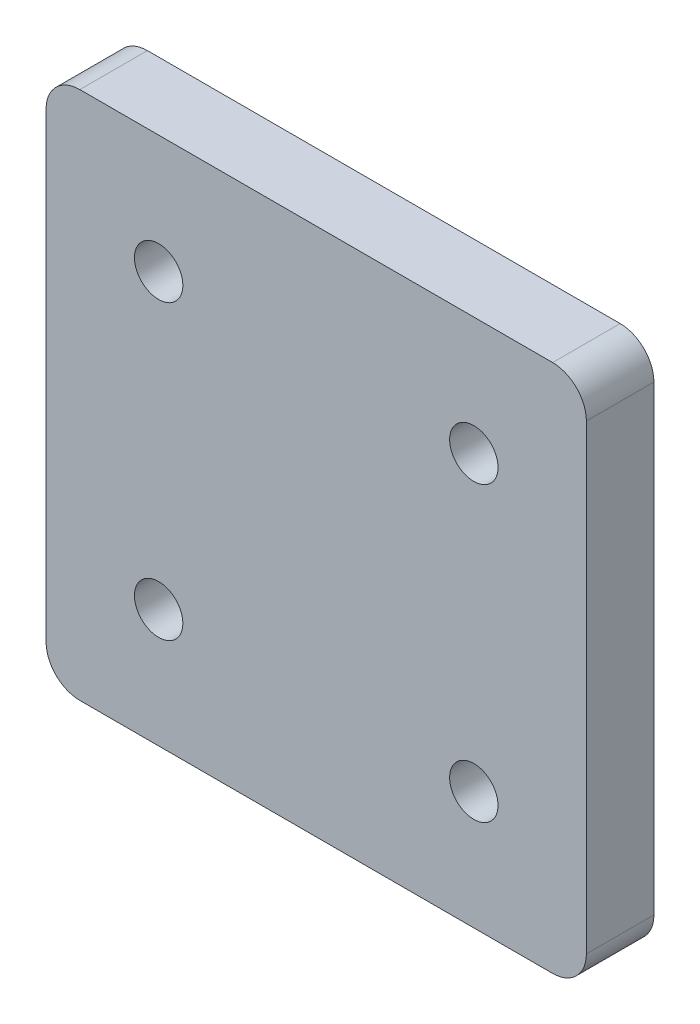
ISO-10303-21;
HEADER;
FILE_DESCRIPTION(('STEP AP214'),'2;1');
FILE_NAME('part.step','',(''),(''),'','','');
FILE_SCHEMA(('AUTOMOTIVE_DESIGN { 1 0 10303 214 1 1 1 1 }'));
ENDSEC;
DATA;
#1=APPLICATION_CONTEXT('core data for automotive mechanical design processes');
#2=APPLICATION_PROTOCOL_DEFINITION('international standard','automotive_design',2000,#1);
#3=PRODUCT_CONTEXT('',#1,'mechanical');
#4=PRODUCT('Part','Part','',(#3));
#5=PRODUCT_RELATED_PRODUCT_CATEGORY('part','',(#4));
#6=PRODUCT_DEFINITION_FORMATION('','',#4);
#7=PRODUCT_DEFINITION_CONTEXT('part definition',#1,'design');
#8=PRODUCT_DEFINITION('design','',#6,#7);
#9=PRODUCT_DEFINITION_SHAPE('','',#8);
#10=(LENGTH_UNIT() NAMED_UNIT(*) SI_UNIT(.MILLI.,.METRE.));
#11=(NAMED_UNIT(*) PLANE_ANGLE_UNIT() SI_UNIT($,.RADIAN.));
#12=(NAMED_UNIT(*) SI_UNIT($,.STERADIAN.) SOLID_ANGLE_UNIT());
#13=UNCERTAINTY_MEASURE_WITH_UNIT(LENGTH_MEASURE(1.E-05),#10,'distance_accuracy_value','');
#14=(GEOMETRIC_REPRESENTATION_CONTEXT(3) GLOBAL_UNCERTAINTY_ASSIGNED_CONTEXT((#13)) GLOBAL_UNIT_ASSIGNED_CONTEXT((#10,
#11,#12)) REPRESENTATION_CONTEXT('',''));
#15=CARTESIAN_POINT('',(0.,0.,0.));
#16=DIRECTION('',(0.,0.,1.));
#17=DIRECTION('',(1.,0.,0.));
#18=AXIS2_PLACEMENT_3D('',#15,#16,#17);
#19=CARTESIAN_POINT('',(0.,0.,6.));
#20=DIRECTION('',(0.,0.,-1.));
#21=DIRECTION('',(-1.,0.,0.));
#22=AXIS2_PLACEMENT_3D('',#19,#20,#21);
#23=PLANE('',#22);
#24=CARTESIAN_POINT('',(14.,-6.49999999999999,6.));
#25=DIRECTION('',(0.,0.,1.));
#26=DIRECTION('',(1.,0.,0.));
#27=AXIS2_PLACEMENT_3D('',#24,#25,#26);
#28=CIRCLE('',#27,2.15);
#29=CARTESIAN_POINT('',(16.15,-6.49999999999999,6.));
#30=VERTEX_POINT('',#29);
#31=EDGE_CURVE('E194',#30,#30,#28,.T.);
#32=ORIENTED_EDGE('',*,*,#31,.F.);
#33=EDGE_LOOP('',(#32));
#34=FACE_BOUND('',#33,.T.);
#35=CARTESIAN_POINT('',(-14.,-32.5,6.));
#36=DIRECTION('',(0.,0.,1.));
#37=DIRECTION('',(1.,0.,0.));
#38=AXIS2_PLACEMENT_3D('',#35,#36,#37);
#39=CIRCLE('',#38,2.15);
#40=CARTESIAN_POINT('',(-11.85,-32.5,6.));
#41=VERTEX_POINT('',#40);
#42=EDGE_CURVE('E188',#41,#41,#39,.T.);
#43=ORIENTED_EDGE('',*,*,#42,.F.);
#44=EDGE_LOOP('',(#43));
#45=FACE_BOUND('',#44,.T.);
#46=CARTESIAN_POINT('',(14.,-32.5,6.));
#47=DIRECTION('',(0.,0.,1.));
#48=DIRECTION('',(1.,0.,0.));
#49=AXIS2_PLACEMENT_3D('',#46,#47,#48);
#50=CIRCLE('',#49,2.15);
#51=CARTESIAN_POINT('',(16.15,-32.5,6.));
#52=VERTEX_POINT('',#51);
#53=EDGE_CURVE('E182',#52,#52,#50,.T.);
#54=ORIENTED_EDGE('',*,*,#53,.F.);
#55=EDGE_LOOP('',(#54));
#56=FACE_BOUND('',#55,.T.);
#57=CARTESIAN_POINT('',(-14.,-6.49999999999999,6.));
#58=DIRECTION('',(0.,0.,1.));
#59=DIRECTION('',(1.,0.,0.));
#60=AXIS2_PLACEMENT_3D('',#57,#58,#59);
#61=CIRCLE('',#60,2.15);
#62=CARTESIAN_POINT('',(-11.85,-6.49999999999999,6.));
#63=VERTEX_POINT('',#62);
#64=EDGE_CURVE('E132',#63,#63,#61,.T.);
#65=ORIENTED_EDGE('',*,*,#64,.F.);
#66=EDGE_LOOP('',(#65));
#67=FACE_BOUND('',#66,.T.);
#68=DIRECTION('',(1.,0.,0.));
#69=VECTOR('',#68,1.);
#70=CARTESIAN_POINT('',(-24.,-43.,6.));
#71=LINE('',#70,#69);
#72=CARTESIAN_POINT('',(-21.,-43.,6.));
#73=VERTEX_POINT('',#72);
#74=CARTESIAN_POINT('',(21.,-43.,6.));
#75=VERTEX_POINT('',#74);
#76=EDGE_CURVE('E135',#73,#75,#71,.T.);
#77=ORIENTED_EDGE('',*,*,#76,.T.);
#78=CARTESIAN_POINT('',(21.,-40.,6.));
#79=DIRECTION('',(0.,0.,-1.));
#80=DIRECTION('',(-1.,0.,0.));
#81=AXIS2_PLACEMENT_3D('',#78,#79,#80);
#82=CIRCLE('',#81,3.);
#83=CARTESIAN_POINT('',(24.,-40.,6.));
#84=VERTEX_POINT('',#83);
#85=EDGE_CURVE('E154',#75,#84,#82,.F.);
#86=ORIENTED_EDGE('',*,*,#85,.T.);
#87=DIRECTION('',(0.,1.,0.));
#88=VECTOR('',#87,1.);
#89=CARTESIAN_POINT('',(24.,-43.,6.));
#90=LINE('',#89,#88);
#91=CARTESIAN_POINT('',(24.,1.,6.));
#92=VERTEX_POINT('',#91);
#93=EDGE_CURVE('E119',#84,#92,#90,.T.);
#94=ORIENTED_EDGE('',*,*,#93,.T.);
#95=CARTESIAN_POINT('',(21.,1.,6.));
#96=DIRECTION('',(0.,0.,-1.));
#97=DIRECTION('',(-1.,0.,0.));
#98=AXIS2_PLACEMENT_3D('',#95,#96,#97);
#99=CIRCLE('',#98,3.);
#100=CARTESIAN_POINT('',(21.,4.,6.));
#101=VERTEX_POINT('',#100);
#102=EDGE_CURVE('E149',#92,#101,#99,.F.);
#103=ORIENTED_EDGE('',*,*,#102,.T.);
#104=DIRECTION('',(-1.,0.,0.));
#105=VECTOR('',#104,1.);
#106=CARTESIAN_POINT('',(-24.,4.,6.));
#107=LINE('',#106,#105);
#108=CARTESIAN_POINT('',(-21.,4.,6.));
#109=VERTEX_POINT('',#108);
#110=EDGE_CURVE('E165',#101,#109,#107,.T.);
#111=ORIENTED_EDGE('',*,*,#110,.T.);
#112=CARTESIAN_POINT('',(-21.,1.,6.));
#113=DIRECTION('',(0.,0.,-1.));
#114=DIRECTION('',(-1.,0.,0.));
#115=AXIS2_PLACEMENT_3D('',#112,#113,#114);
#116=CIRCLE('',#115,3.);
#117=CARTESIAN_POINT('',(-24.,1.,6.));
#118=VERTEX_POINT('',#117);
#119=EDGE_CURVE('E55',#109,#118,#116,.F.);
#120=ORIENTED_EDGE('',*,*,#119,.T.);
#121=DIRECTION('',(0.,-1.,0.));
#122=VECTOR('',#121,1.);
#123=CARTESIAN_POINT('',(-24.,-43.,6.));
#124=LINE('',#123,#122);
#125=CARTESIAN_POINT('',(-24.,-40.,6.));
#126=VERTEX_POINT('',#125);
#127=EDGE_CURVE('E173',#118,#126,#124,.T.);
#128=ORIENTED_EDGE('',*,*,#127,.T.);
#129=CARTESIAN_POINT('',(-21.,-40.,6.));
#130=DIRECTION('',(0.,0.,-1.));
#131=DIRECTION('',(-1.,0.,0.));
#132=AXIS2_PLACEMENT_3D('',#129,#130,#131);
#133=CIRCLE('',#132,3.);
#134=EDGE_CURVE('E151',#126,#73,#133,.F.);
#135=ORIENTED_EDGE('',*,*,#134,.T.);
#136=EDGE_LOOP('',(#77,#86,#94,#103,#111,#120,#128,#135));
#137=FACE_BOUND('',#136,.T.);
#138=ADVANCED_FACE('F33',(#34,#45,#56,#67,#137),#23,.F.);
#139=CARTESIAN_POINT('',(0.,0.,0.));
#140=DIRECTION('',(0.,0.,-1.));
#141=DIRECTION('',(-1.,0.,0.));
#142=AXIS2_PLACEMENT_3D('',#139,#140,#141);
#143=PLANE('',#142);
#144=CARTESIAN_POINT('',(14.,-6.49999999999999,0.));
#145=DIRECTION('',(0.,0.,1.));
#146=DIRECTION('',(1.,0.,0.));
#147=AXIS2_PLACEMENT_3D('',#144,#145,#146);
#148=CIRCLE('',#147,2.15);
#149=CARTESIAN_POINT('',(16.15,-6.49999999999999,0.));
#150=VERTEX_POINT('',#149);
#151=EDGE_CURVE('E180',#150,#150,#148,.T.);
#152=ORIENTED_EDGE('',*,*,#151,.T.);
#153=EDGE_LOOP('',(#152));
#154=FACE_BOUND('',#153,.T.);
#155=CARTESIAN_POINT('',(-14.,-32.5,0.));
#156=DIRECTION('',(0.,0.,1.));
#157=DIRECTION('',(1.,0.,0.));
#158=AXIS2_PLACEMENT_3D('',#155,#156,#157);
#159=CIRCLE('',#158,2.15);
#160=CARTESIAN_POINT('',(-11.85,-32.5,0.));
#161=VERTEX_POINT('',#160);
#162=EDGE_CURVE('E191',#161,#161,#159,.T.);
#163=ORIENTED_EDGE('',*,*,#162,.T.);
#164=EDGE_LOOP('',(#163));
#165=FACE_BOUND('',#164,.T.);
#166=CARTESIAN_POINT('',(14.,-32.5,0.));
#167=DIRECTION('',(0.,0.,1.));
#168=DIRECTION('',(1.,0.,0.));
#169=AXIS2_PLACEMENT_3D('',#166,#167,#168);
#170=CIRCLE('',#169,2.15);
#171=CARTESIAN_POINT('',(16.15,-32.5,0.));
#172=VERTEX_POINT('',#171);
#173=EDGE_CURVE('E185',#172,#172,#170,.T.);
#174=ORIENTED_EDGE('',*,*,#173,.T.);
#175=EDGE_LOOP('',(#174));
#176=FACE_BOUND('',#175,.T.);
#177=CARTESIAN_POINT('',(-14.,-6.49999999999999,0.));
#178=DIRECTION('',(0.,0.,1.));
#179=DIRECTION('',(1.,0.,0.));
#180=AXIS2_PLACEMENT_3D('',#177,#178,#179);
#181=CIRCLE('',#180,2.15);
#182=CARTESIAN_POINT('',(-11.85,-6.49999999999999,0.));
#183=VERTEX_POINT('',#182);
#184=EDGE_CURVE('E126',#183,#183,#181,.T.);
#185=ORIENTED_EDGE('',*,*,#184,.T.);
#186=EDGE_LOOP('',(#185));
#187=FACE_BOUND('',#186,.T.);
#188=DIRECTION('',(0.,1.,0.));
#189=VECTOR('',#188,1.);
#190=CARTESIAN_POINT('',(24.,-43.,0.));
#191=LINE('',#190,#189);
#192=CARTESIAN_POINT('',(24.,-40.,0.));
#193=VERTEX_POINT('',#192);
#194=CARTESIAN_POINT('',(24.,1.,0.));
#195=VERTEX_POINT('',#194);
#196=EDGE_CURVE('E116',#193,#195,#191,.T.);
#197=ORIENTED_EDGE('',*,*,#196,.F.);
#198=CARTESIAN_POINT('',(21.,-40.,0.));
#199=DIRECTION('',(0.,0.,-1.));
#200=DIRECTION('',(-1.,0.,0.));
#201=AXIS2_PLACEMENT_3D('',#198,#199,#200);
#202=CIRCLE('',#201,3.);
#203=CARTESIAN_POINT('',(21.,-43.,0.));
#204=VERTEX_POINT('',#203);
#205=EDGE_CURVE('E99',#193,#204,#202,.T.);
#206=ORIENTED_EDGE('',*,*,#205,.T.);
#207=DIRECTION('',(1.,0.,0.));
#208=VECTOR('',#207,1.);
#209=CARTESIAN_POINT('',(-24.,-43.,0.));
#210=LINE('',#209,#208);
#211=CARTESIAN_POINT('',(-21.,-43.,0.));
#212=VERTEX_POINT('',#211);
#213=EDGE_CURVE('E139',#212,#204,#210,.T.);
#214=ORIENTED_EDGE('',*,*,#213,.F.);
#215=CARTESIAN_POINT('',(-21.,-40.,0.));
#216=DIRECTION('',(0.,0.,-1.));
#217=DIRECTION('',(-1.,0.,0.));
#218=AXIS2_PLACEMENT_3D('',#215,#216,#217);
#219=CIRCLE('',#218,3.);
#220=CARTESIAN_POINT('',(-24.,-40.,0.));
#221=VERTEX_POINT('',#220);
#222=EDGE_CURVE('E143',#212,#221,#219,.T.);
#223=ORIENTED_EDGE('',*,*,#222,.T.);
#224=DIRECTION('',(0.,-1.,0.));
#225=VECTOR('',#224,1.);
#226=CARTESIAN_POINT('',(-24.,-43.,0.));
#227=LINE('',#226,#225);
#228=CARTESIAN_POINT('',(-24.,1.,0.));
#229=VERTEX_POINT('',#228);
#230=EDGE_CURVE('E129',#229,#221,#227,.T.);
#231=ORIENTED_EDGE('',*,*,#230,.F.);
#232=CARTESIAN_POINT('',(-21.,1.,0.));
#233=DIRECTION('',(0.,0.,-1.));
#234=DIRECTION('',(-1.,0.,0.));
#235=AXIS2_PLACEMENT_3D('',#232,#233,#234);
#236=CIRCLE('',#235,3.);
#237=CARTESIAN_POINT('',(-21.,4.,0.));
#238=VERTEX_POINT('',#237);
#239=EDGE_CURVE('E110',#229,#238,#236,.T.);
#240=ORIENTED_EDGE('',*,*,#239,.T.);
#241=DIRECTION('',(-1.,0.,0.));
#242=VECTOR('',#241,1.);
#243=CARTESIAN_POINT('',(-24.,4.,0.));
#244=LINE('',#243,#242);
#245=CARTESIAN_POINT('',(21.,4.,0.));
#246=VERTEX_POINT('',#245);
#247=EDGE_CURVE('E125',#246,#238,#244,.T.);
#248=ORIENTED_EDGE('',*,*,#247,.F.);
#249=CARTESIAN_POINT('',(21.,1.,0.));
#250=DIRECTION('',(0.,0.,-1.));
#251=DIRECTION('',(-1.,0.,0.));
#252=AXIS2_PLACEMENT_3D('',#249,#250,#251);
#253=CIRCLE('',#252,3.);
#254=EDGE_CURVE('E120',#246,#195,#253,.T.);
#255=ORIENTED_EDGE('',*,*,#254,.T.);
#256=EDGE_LOOP('',(#197,#206,#214,#223,#231,#240,#248,#255));
#257=FACE_BOUND('',#256,.T.);
#258=ADVANCED_FACE('F123',(#154,#165,#176,#187,#257),#143,.T.);
#259=CARTESIAN_POINT('',(24.,-43.,6.));
#260=DIRECTION('',(-1.,0.,0.));
#261=DIRECTION('',(0.,0.,1.));
#262=AXIS2_PLACEMENT_3D('',#259,#260,#261);
#263=PLANE('',#262);
#264=ORIENTED_EDGE('',*,*,#93,.F.);
#265=DIRECTION('',(0.,0.,-1.));
#266=VECTOR('',#265,1.);
#267=CARTESIAN_POINT('',(24.,-40.,6.));
#268=LINE('',#267,#266);
#269=EDGE_CURVE('E103',#84,#193,#268,.T.);
#270=ORIENTED_EDGE('',*,*,#269,.T.);
#271=ORIENTED_EDGE('',*,*,#196,.T.);
#272=DIRECTION('',(0.,0.,-1.));
#273=VECTOR('',#272,1.);
#274=CARTESIAN_POINT('',(24.,1.,6.));
#275=LINE('',#274,#273);
#276=EDGE_CURVE('E121',#195,#92,#275,.F.);
#277=ORIENTED_EDGE('',*,*,#276,.T.);
#278=EDGE_LOOP('',(#264,#270,#271,#277));
#279=FACE_BOUND('',#278,.T.);
#280=ADVANCED_FACE('F115',(#279),#263,.F.);
#281=CARTESIAN_POINT('',(-24.,4.,6.));
#282=DIRECTION('',(0.,-1.,0.));
#283=DIRECTION('',(0.,0.,-1.));
#284=AXIS2_PLACEMENT_3D('',#281,#282,#283);
#285=PLANE('',#284);
#286=ORIENTED_EDGE('',*,*,#247,.T.);
#287=DIRECTION('',(0.,0.,-1.));
#288=VECTOR('',#287,1.);
#289=CARTESIAN_POINT('',(-21.,4.,6.));
#290=LINE('',#289,#288);
#291=EDGE_CURVE('E11',#238,#109,#290,.F.);
#292=ORIENTED_EDGE('',*,*,#291,.T.);
#293=ORIENTED_EDGE('',*,*,#110,.F.);
#294=DIRECTION('',(0.,0.,-1.));
#295=VECTOR('',#294,1.);
#296=CARTESIAN_POINT('',(21.,4.,6.));
#297=LINE('',#296,#295);
#298=EDGE_CURVE('E41',#101,#246,#297,.T.);
#299=ORIENTED_EDGE('',*,*,#298,.T.);
#300=EDGE_LOOP('',(#286,#292,#293,#299));
#301=FACE_BOUND('',#300,.T.);
#302=ADVANCED_FACE('F163',(#301),#285,.F.);
#303=CARTESIAN_POINT('',(-24.,-43.,6.));
#304=DIRECTION('',(1.,0.,0.));
#305=DIRECTION('',(0.,0.,-1.));
#306=AXIS2_PLACEMENT_3D('',#303,#304,#305);
#307=PLANE('',#306);
#308=ORIENTED_EDGE('',*,*,#127,.F.);
#309=DIRECTION('',(0.,0.,-1.));
#310=VECTOR('',#309,1.);
#311=CARTESIAN_POINT('',(-24.,1.,6.));
#312=LINE('',#311,#310);
#313=EDGE_CURVE('E157',#118,#229,#312,.T.);
#314=ORIENTED_EDGE('',*,*,#313,.T.);
#315=ORIENTED_EDGE('',*,*,#230,.T.);
#316=DIRECTION('',(0.,0.,-1.));
#317=VECTOR('',#316,1.);
#318=CARTESIAN_POINT('',(-24.,-40.,6.));
#319=LINE('',#318,#317);
#320=EDGE_CURVE('E48',#221,#126,#319,.F.);
#321=ORIENTED_EDGE('',*,*,#320,.T.);
#322=EDGE_LOOP('',(#308,#314,#315,#321));
#323=FACE_BOUND('',#322,.T.);
#324=ADVANCED_FACE('F172',(#323),#307,.F.);
#325=CARTESIAN_POINT('',(-24.,-43.,6.));
#326=DIRECTION('',(0.,1.,0.));
#327=DIRECTION('',(0.,0.,1.));
#328=AXIS2_PLACEMENT_3D('',#325,#326,#327);
#329=PLANE('',#328);
#330=ORIENTED_EDGE('',*,*,#213,.T.);
#331=DIRECTION('',(0.,0.,-1.));
#332=VECTOR('',#331,1.);
#333=CARTESIAN_POINT('',(21.,-43.,6.));
#334=LINE('',#333,#332);
#335=EDGE_CURVE('E104',#204,#75,#334,.F.);
#336=ORIENTED_EDGE('',*,*,#335,.T.);
#337=ORIENTED_EDGE('',*,*,#76,.F.);
#338=DIRECTION('',(0.,0.,-1.));
#339=VECTOR('',#338,1.);
#340=CARTESIAN_POINT('',(-21.,-43.,6.));
#341=LINE('',#340,#339);
#342=EDGE_CURVE('E109',#73,#212,#341,.T.);
#343=ORIENTED_EDGE('',*,*,#342,.T.);
#344=EDGE_LOOP('',(#330,#336,#337,#343));
#345=FACE_BOUND('',#344,.T.);
#346=ADVANCED_FACE('F220',(#345),#329,.F.);
#347=CARTESIAN_POINT('',(-14.,-6.49999999999999,0.));
#348=DIRECTION('',(0.,0.,1.));
#349=DIRECTION('',(1.,0.,0.));
#350=AXIS2_PLACEMENT_3D('',#347,#348,#349);
#351=CYLINDRICAL_SURFACE('',#350,2.15);
#352=ORIENTED_EDGE('',*,*,#184,.F.);
#353=EDGE_LOOP('',(#352));
#354=FACE_BOUND('',#353,.T.);
#355=ORIENTED_EDGE('',*,*,#64,.T.);
#356=EDGE_LOOP('',(#355));
#357=FACE_BOUND('',#356,.T.);
#358=ADVANCED_FACE('F240',(#354,#357),#351,.F.);
#359=CARTESIAN_POINT('',(14.,-32.5,0.));
#360=DIRECTION('',(0.,0.,1.));
#361=DIRECTION('',(1.,0.,0.));
#362=AXIS2_PLACEMENT_3D('',#359,#360,#361);
#363=CYLINDRICAL_SURFACE('',#362,2.15);
#364=ORIENTED_EDGE('',*,*,#173,.F.);
#365=EDGE_LOOP('',(#364));
#366=FACE_BOUND('',#365,.T.);
#367=ORIENTED_EDGE('',*,*,#53,.T.);
#368=EDGE_LOOP('',(#367));
#369=FACE_BOUND('',#368,.T.);
#370=ADVANCED_FACE('F245',(#366,#369),#363,.F.);
#371=CARTESIAN_POINT('',(-14.,-32.5,0.));
#372=DIRECTION('',(0.,0.,1.));
#373=DIRECTION('',(1.,0.,0.));
#374=AXIS2_PLACEMENT_3D('',#371,#372,#373);
#375=CYLINDRICAL_SURFACE('',#374,2.15);
#376=ORIENTED_EDGE('',*,*,#162,.F.);
#377=EDGE_LOOP('',(#376));
#378=FACE_BOUND('',#377,.T.);
#379=ORIENTED_EDGE('',*,*,#42,.T.);
#380=EDGE_LOOP('',(#379));
#381=FACE_BOUND('',#380,.T.);
#382=ADVANCED_FACE('F205',(#378,#381),#375,.F.);
#383=CARTESIAN_POINT('',(14.,-6.49999999999999,0.));
#384=DIRECTION('',(0.,0.,1.));
#385=DIRECTION('',(1.,0.,0.));
#386=AXIS2_PLACEMENT_3D('',#383,#384,#385);
#387=CYLINDRICAL_SURFACE('',#386,2.15);
#388=ORIENTED_EDGE('',*,*,#151,.F.);
#389=EDGE_LOOP('',(#388));
#390=FACE_BOUND('',#389,.T.);
#391=ORIENTED_EDGE('',*,*,#31,.T.);
#392=EDGE_LOOP('',(#391));
#393=FACE_BOUND('',#392,.T.);
#394=ADVANCED_FACE('F202',(#390,#393),#387,.F.);
#395=CARTESIAN_POINT('',(21.,-40.,6.));
#396=DIRECTION('',(0.,0.,-1.));
#397=DIRECTION('',(-1.,0.,0.));
#398=AXIS2_PLACEMENT_3D('',#395,#396,#397);
#399=CYLINDRICAL_SURFACE('',#398,3.);
#400=ORIENTED_EDGE('',*,*,#85,.F.);
#401=ORIENTED_EDGE('',*,*,#335,.F.);
#402=ORIENTED_EDGE('',*,*,#205,.F.);
#403=ORIENTED_EDGE('',*,*,#269,.F.);
#404=EDGE_LOOP('',(#400,#401,#402,#403));
#405=FACE_BOUND('',#404,.T.);
#406=ADVANCED_FACE('F102',(#405),#399,.T.);
#407=CARTESIAN_POINT('',(-21.,1.,6.));
#408=DIRECTION('',(0.,0.,-1.));
#409=DIRECTION('',(-1.,0.,0.));
#410=AXIS2_PLACEMENT_3D('',#407,#408,#409);
#411=CYLINDRICAL_SURFACE('',#410,3.);
#412=ORIENTED_EDGE('',*,*,#119,.F.);
#413=ORIENTED_EDGE('',*,*,#291,.F.);
#414=ORIENTED_EDGE('',*,*,#239,.F.);
#415=ORIENTED_EDGE('',*,*,#313,.F.);
#416=EDGE_LOOP('',(#412,#413,#414,#415));
#417=FACE_BOUND('',#416,.T.);
#418=ADVANCED_FACE('F171',(#417),#411,.T.);
#419=CARTESIAN_POINT('',(-21.,-40.,6.));
#420=DIRECTION('',(0.,0.,-1.));
#421=DIRECTION('',(-1.,0.,0.));
#422=AXIS2_PLACEMENT_3D('',#419,#420,#421);
#423=CYLINDRICAL_SURFACE('',#422,3.);
#424=ORIENTED_EDGE('',*,*,#134,.F.);
#425=ORIENTED_EDGE('',*,*,#320,.F.);
#426=ORIENTED_EDGE('',*,*,#222,.F.);
#427=ORIENTED_EDGE('',*,*,#342,.F.);
#428=EDGE_LOOP('',(#424,#425,#426,#427));
#429=FACE_BOUND('',#428,.T.);
#430=ADVANCED_FACE('F222',(#429),#423,.T.);
#431=CARTESIAN_POINT('',(21.,1.,6.));
#432=DIRECTION('',(0.,0.,-1.));
#433=DIRECTION('',(-1.,0.,0.));
#434=AXIS2_PLACEMENT_3D('',#431,#432,#433);
#435=CYLINDRICAL_SURFACE('',#434,3.);
#436=ORIENTED_EDGE('',*,*,#102,.F.);
#437=ORIENTED_EDGE('',*,*,#276,.F.);
#438=ORIENTED_EDGE('',*,*,#254,.F.);
#439=ORIENTED_EDGE('',*,*,#298,.F.);
#440=EDGE_LOOP('',(#436,#437,#438,#439));
#441=FACE_BOUND('',#440,.T.);
#442=ADVANCED_FACE('F35',(#441),#435,.T.);
#443=CLOSED_SHELL('',(#138,#258,#280,#302,#324,#346,#358,#370,#382,#394,#406,#418,#430,#442));
#444=MANIFOLD_SOLID_BREP('B2',#443);
#445=ADVANCED_BREP_SHAPE_REPRESENTATION('',(#18,#444),#14);
#446=SHAPE_DEFINITION_REPRESENTATION(#9,#445);
ENDSEC;
END-ISO-10303-21;
